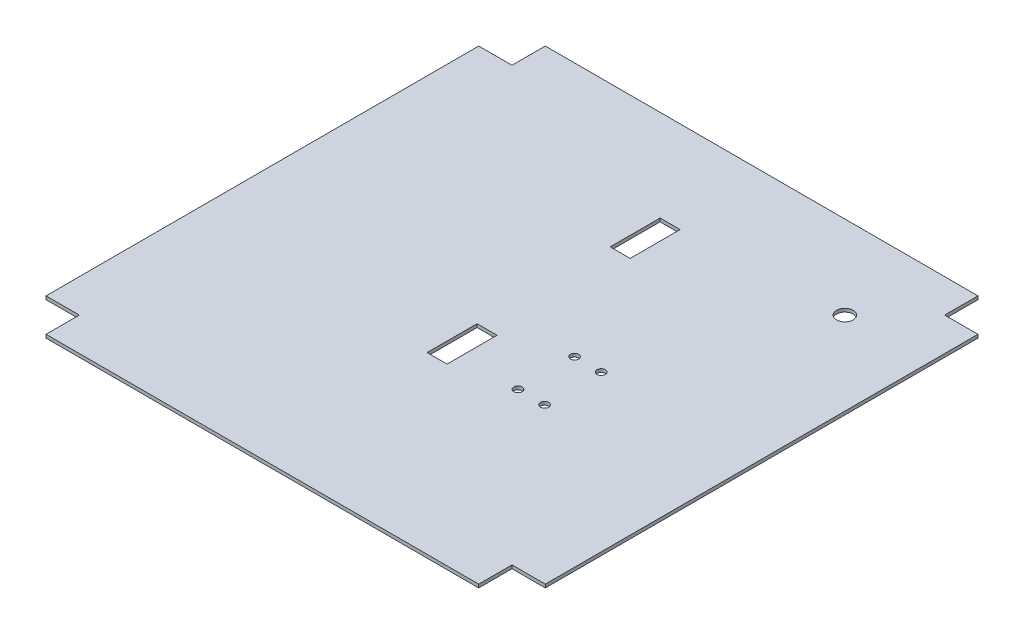
ISO-10303-21;
HEADER;
FILE_DESCRIPTION(('STEP AP214'),'2;1');
FILE_NAME('part.step','',(''),(''),'','','');
FILE_SCHEMA(('AUTOMOTIVE_DESIGN { 1 0 10303 214 1 1 1 1 }'));
ENDSEC;
DATA;
#1=APPLICATION_CONTEXT('core data for automotive mechanical design processes');
#2=APPLICATION_PROTOCOL_DEFINITION('international standard','automotive_design',2000,#1);
#3=PRODUCT_CONTEXT('',#1,'mechanical');
#4=PRODUCT('Part','Part','',(#3));
#5=PRODUCT_RELATED_PRODUCT_CATEGORY('part','',(#4));
#6=PRODUCT_DEFINITION_FORMATION('','',#4);
#7=PRODUCT_DEFINITION_CONTEXT('part definition',#1,'design');
#8=PRODUCT_DEFINITION('design','',#6,#7);
#9=PRODUCT_DEFINITION_SHAPE('','',#8);
#10=(LENGTH_UNIT() NAMED_UNIT(*) SI_UNIT(.MILLI.,.METRE.));
#11=(NAMED_UNIT(*) PLANE_ANGLE_UNIT() SI_UNIT($,.RADIAN.));
#12=(NAMED_UNIT(*) SI_UNIT($,.STERADIAN.) SOLID_ANGLE_UNIT());
#13=UNCERTAINTY_MEASURE_WITH_UNIT(LENGTH_MEASURE(1.E-05),#10,'distance_accuracy_value','');
#14=(GEOMETRIC_REPRESENTATION_CONTEXT(3) GLOBAL_UNCERTAINTY_ASSIGNED_CONTEXT((#13)) GLOBAL_UNIT_ASSIGNED_CONTEXT((#10,
#11,#12)) REPRESENTATION_CONTEXT('',''));
#15=CARTESIAN_POINT('',(0.,0.,0.));
#16=DIRECTION('',(0.,0.,1.));
#17=DIRECTION('',(1.,0.,0.));
#18=AXIS2_PLACEMENT_3D('',#15,#16,#17);
#19=CARTESIAN_POINT('',(-130.,2.,-150.));
#20=DIRECTION('',(0.,0.,1.));
#21=DIRECTION('',(1.,0.,0.));
#22=AXIS2_PLACEMENT_3D('',#19,#20,#21);
#23=PLANE('',#22);
#24=DIRECTION('',(-1.,0.,0.));
#25=VECTOR('',#24,1.);
#26=CARTESIAN_POINT('',(-130.,0.,-150.));
#27=LINE('',#26,#25);
#28=CARTESIAN_POINT('',(130.,0.,-150.));
#29=VERTEX_POINT('',#28);
#30=CARTESIAN_POINT('',(-130.,0.,-150.));
#31=VERTEX_POINT('',#30);
#32=EDGE_CURVE('E264',#29,#31,#27,.T.);
#33=ORIENTED_EDGE('',*,*,#32,.T.);
#34=DIRECTION('',(0.,-1.,0.));
#35=VECTOR('',#34,1.);
#36=CARTESIAN_POINT('',(-130.,2.,-150.));
#37=LINE('',#36,#35);
#38=CARTESIAN_POINT('',(-130.,2.,-150.));
#39=VERTEX_POINT('',#38);
#40=EDGE_CURVE('E320',#39,#31,#37,.T.);
#41=ORIENTED_EDGE('',*,*,#40,.F.);
#42=DIRECTION('',(-1.,0.,0.));
#43=VECTOR('',#42,1.);
#44=CARTESIAN_POINT('',(-130.,2.,-150.));
#45=LINE('',#44,#43);
#46=CARTESIAN_POINT('',(130.,2.,-150.));
#47=VERTEX_POINT('',#46);
#48=EDGE_CURVE('E237',#47,#39,#45,.T.);
#49=ORIENTED_EDGE('',*,*,#48,.F.);
#50=DIRECTION('',(0.,-1.,0.));
#51=VECTOR('',#50,1.);
#52=CARTESIAN_POINT('',(130.,2.,-150.));
#53=LINE('',#52,#51);
#54=EDGE_CURVE('E263',#47,#29,#53,.T.);
#55=ORIENTED_EDGE('',*,*,#54,.T.);
#56=EDGE_LOOP('',(#33,#41,#49,#55));
#57=FACE_BOUND('',#56,.T.);
#58=ADVANCED_FACE('F35',(#57),#23,.F.);
#59=CARTESIAN_POINT('',(-130.,2.,-150.));
#60=DIRECTION('',(1.,0.,0.));
#61=DIRECTION('',(0.,0.,-1.));
#62=AXIS2_PLACEMENT_3D('',#59,#60,#61);
#63=PLANE('',#62);
#64=DIRECTION('',(0.,0.,1.));
#65=VECTOR('',#64,1.);
#66=CARTESIAN_POINT('',(-130.,0.,-150.));
#67=LINE('',#66,#65);
#68=CARTESIAN_POINT('',(-130.,0.,-130.));
#69=VERTEX_POINT('',#68);
#70=EDGE_CURVE('E267',#31,#69,#67,.T.);
#71=ORIENTED_EDGE('',*,*,#70,.T.);
#72=DIRECTION('',(0.,-1.,0.));
#73=VECTOR('',#72,1.);
#74=CARTESIAN_POINT('',(-130.,2.,-130.));
#75=LINE('',#74,#73);
#76=CARTESIAN_POINT('',(-130.,2.,-130.));
#77=VERTEX_POINT('',#76);
#78=EDGE_CURVE('E317',#77,#69,#75,.T.);
#79=ORIENTED_EDGE('',*,*,#78,.F.);
#80=DIRECTION('',(0.,0.,1.));
#81=VECTOR('',#80,1.);
#82=CARTESIAN_POINT('',(-130.,2.,-150.));
#83=LINE('',#82,#81);
#84=EDGE_CURVE('E240',#39,#77,#83,.T.);
#85=ORIENTED_EDGE('',*,*,#84,.F.);
#86=ORIENTED_EDGE('',*,*,#40,.T.);
#87=EDGE_LOOP('',(#71,#79,#85,#86));
#88=FACE_BOUND('',#87,.T.);
#89=ADVANCED_FACE('F428',(#88),#63,.F.);
#90=CARTESIAN_POINT('',(-130.,2.,-130.));
#91=DIRECTION('',(0.,0.,1.));
#92=DIRECTION('',(1.,0.,0.));
#93=AXIS2_PLACEMENT_3D('',#90,#91,#92);
#94=PLANE('',#93);
#95=DIRECTION('',(-1.,0.,0.));
#96=VECTOR('',#95,1.);
#97=CARTESIAN_POINT('',(-130.,0.,-130.));
#98=LINE('',#97,#96);
#99=CARTESIAN_POINT('',(-150.,0.,-130.));
#100=VERTEX_POINT('',#99);
#101=EDGE_CURVE('E269',#69,#100,#98,.T.);
#102=ORIENTED_EDGE('',*,*,#101,.T.);
#103=DIRECTION('',(0.,-1.,0.));
#104=VECTOR('',#103,1.);
#105=CARTESIAN_POINT('',(-150.,2.,-130.));
#106=LINE('',#105,#104);
#107=CARTESIAN_POINT('',(-150.,2.,-130.));
#108=VERTEX_POINT('',#107);
#109=EDGE_CURVE('E314',#108,#100,#106,.T.);
#110=ORIENTED_EDGE('',*,*,#109,.F.);
#111=DIRECTION('',(-1.,0.,0.));
#112=VECTOR('',#111,1.);
#113=CARTESIAN_POINT('',(-130.,2.,-130.));
#114=LINE('',#113,#112);
#115=EDGE_CURVE('E243',#77,#108,#114,.T.);
#116=ORIENTED_EDGE('',*,*,#115,.F.);
#117=ORIENTED_EDGE('',*,*,#78,.T.);
#118=EDGE_LOOP('',(#102,#110,#116,#117));
#119=FACE_BOUND('',#118,.T.);
#120=ADVANCED_FACE('F425',(#119),#94,.F.);
#121=CARTESIAN_POINT('',(-150.,2.,-130.));
#122=DIRECTION('',(1.,0.,0.));
#123=DIRECTION('',(0.,0.,-1.));
#124=AXIS2_PLACEMENT_3D('',#121,#122,#123);
#125=PLANE('',#124);
#126=DIRECTION('',(0.,0.,1.));
#127=VECTOR('',#126,1.);
#128=CARTESIAN_POINT('',(-150.,0.,-130.));
#129=LINE('',#128,#127);
#130=CARTESIAN_POINT('',(-150.,0.,130.));
#131=VERTEX_POINT('',#130);
#132=EDGE_CURVE('E271',#100,#131,#129,.T.);
#133=ORIENTED_EDGE('',*,*,#132,.T.);
#134=DIRECTION('',(0.,-1.,0.));
#135=VECTOR('',#134,1.);
#136=CARTESIAN_POINT('',(-150.,2.,130.));
#137=LINE('',#136,#135);
#138=CARTESIAN_POINT('',(-150.,2.,130.));
#139=VERTEX_POINT('',#138);
#140=EDGE_CURVE('E311',#139,#131,#137,.T.);
#141=ORIENTED_EDGE('',*,*,#140,.F.);
#142=DIRECTION('',(0.,0.,1.));
#143=VECTOR('',#142,1.);
#144=CARTESIAN_POINT('',(-150.,2.,-130.));
#145=LINE('',#144,#143);
#146=EDGE_CURVE('E245',#108,#139,#145,.T.);
#147=ORIENTED_EDGE('',*,*,#146,.F.);
#148=ORIENTED_EDGE('',*,*,#109,.T.);
#149=EDGE_LOOP('',(#133,#141,#147,#148));
#150=FACE_BOUND('',#149,.T.);
#151=ADVANCED_FACE('F420',(#150),#125,.F.);
#152=CARTESIAN_POINT('',(-150.,2.,130.));
#153=DIRECTION('',(0.,0.,-1.));
#154=DIRECTION('',(-1.,0.,0.));
#155=AXIS2_PLACEMENT_3D('',#152,#153,#154);
#156=PLANE('',#155);
#157=DIRECTION('',(1.,0.,0.));
#158=VECTOR('',#157,1.);
#159=CARTESIAN_POINT('',(-150.,0.,130.));
#160=LINE('',#159,#158);
#161=CARTESIAN_POINT('',(-130.,0.,130.));
#162=VERTEX_POINT('',#161);
#163=EDGE_CURVE('E273',#131,#162,#160,.T.);
#164=ORIENTED_EDGE('',*,*,#163,.T.);
#165=DIRECTION('',(0.,-1.,0.));
#166=VECTOR('',#165,1.);
#167=CARTESIAN_POINT('',(-130.,2.,130.));
#168=LINE('',#167,#166);
#169=CARTESIAN_POINT('',(-130.,2.,130.));
#170=VERTEX_POINT('',#169);
#171=EDGE_CURVE('E308',#170,#162,#168,.T.);
#172=ORIENTED_EDGE('',*,*,#171,.F.);
#173=DIRECTION('',(1.,0.,0.));
#174=VECTOR('',#173,1.);
#175=CARTESIAN_POINT('',(-150.,2.,130.));
#176=LINE('',#175,#174);
#177=EDGE_CURVE('E247',#139,#170,#176,.T.);
#178=ORIENTED_EDGE('',*,*,#177,.F.);
#179=ORIENTED_EDGE('',*,*,#140,.T.);
#180=EDGE_LOOP('',(#164,#172,#178,#179));
#181=FACE_BOUND('',#180,.T.);
#182=ADVANCED_FACE('F416',(#181),#156,.F.);
#183=CARTESIAN_POINT('',(-130.,2.,130.));
#184=DIRECTION('',(1.,0.,0.));
#185=DIRECTION('',(0.,0.,-1.));
#186=AXIS2_PLACEMENT_3D('',#183,#184,#185);
#187=PLANE('',#186);
#188=DIRECTION('',(0.,0.,1.));
#189=VECTOR('',#188,1.);
#190=CARTESIAN_POINT('',(-130.,0.,130.));
#191=LINE('',#190,#189);
#192=CARTESIAN_POINT('',(-130.,0.,150.));
#193=VERTEX_POINT('',#192);
#194=EDGE_CURVE('E275',#162,#193,#191,.T.);
#195=ORIENTED_EDGE('',*,*,#194,.T.);
#196=DIRECTION('',(0.,-1.,0.));
#197=VECTOR('',#196,1.);
#198=CARTESIAN_POINT('',(-130.,2.,150.));
#199=LINE('',#198,#197);
#200=CARTESIAN_POINT('',(-130.,2.,150.));
#201=VERTEX_POINT('',#200);
#202=EDGE_CURVE('E305',#201,#193,#199,.T.);
#203=ORIENTED_EDGE('',*,*,#202,.F.);
#204=DIRECTION('',(0.,0.,1.));
#205=VECTOR('',#204,1.);
#206=CARTESIAN_POINT('',(-130.,2.,130.));
#207=LINE('',#206,#205);
#208=EDGE_CURVE('E249',#170,#201,#207,.T.);
#209=ORIENTED_EDGE('',*,*,#208,.F.);
#210=ORIENTED_EDGE('',*,*,#171,.T.);
#211=EDGE_LOOP('',(#195,#203,#209,#210));
#212=FACE_BOUND('',#211,.T.);
#213=ADVANCED_FACE('F412',(#212),#187,.F.);
#214=CARTESIAN_POINT('',(-130.,2.,150.));
#215=DIRECTION('',(0.,0.,-1.));
#216=DIRECTION('',(-1.,0.,0.));
#217=AXIS2_PLACEMENT_3D('',#214,#215,#216);
#218=PLANE('',#217);
#219=DIRECTION('',(1.,0.,0.));
#220=VECTOR('',#219,1.);
#221=CARTESIAN_POINT('',(-130.,0.,150.));
#222=LINE('',#221,#220);
#223=CARTESIAN_POINT('',(130.,0.,150.));
#224=VERTEX_POINT('',#223);
#225=EDGE_CURVE('E277',#193,#224,#222,.T.);
#226=ORIENTED_EDGE('',*,*,#225,.T.);
#227=DIRECTION('',(0.,-1.,0.));
#228=VECTOR('',#227,1.);
#229=CARTESIAN_POINT('',(130.,2.,150.));
#230=LINE('',#229,#228);
#231=CARTESIAN_POINT('',(130.,2.,150.));
#232=VERTEX_POINT('',#231);
#233=EDGE_CURVE('E302',#232,#224,#230,.T.);
#234=ORIENTED_EDGE('',*,*,#233,.F.);
#235=DIRECTION('',(1.,0.,0.));
#236=VECTOR('',#235,1.);
#237=CARTESIAN_POINT('',(-130.,2.,150.));
#238=LINE('',#237,#236);
#239=EDGE_CURVE('E251',#201,#232,#238,.T.);
#240=ORIENTED_EDGE('',*,*,#239,.F.);
#241=ORIENTED_EDGE('',*,*,#202,.T.);
#242=EDGE_LOOP('',(#226,#234,#240,#241));
#243=FACE_BOUND('',#242,.T.);
#244=ADVANCED_FACE('F407',(#243),#218,.F.);
#245=CARTESIAN_POINT('',(130.,2.,130.));
#246=DIRECTION('',(-1.,0.,0.));
#247=DIRECTION('',(0.,0.,1.));
#248=AXIS2_PLACEMENT_3D('',#245,#246,#247);
#249=PLANE('',#248);
#250=DIRECTION('',(0.,0.,-1.));
#251=VECTOR('',#250,1.);
#252=CARTESIAN_POINT('',(130.,0.,130.));
#253=LINE('',#252,#251);
#254=CARTESIAN_POINT('',(130.,0.,130.));
#255=VERTEX_POINT('',#254);
#256=EDGE_CURVE('E279',#224,#255,#253,.T.);
#257=ORIENTED_EDGE('',*,*,#256,.T.);
#258=DIRECTION('',(0.,-1.,0.));
#259=VECTOR('',#258,1.);
#260=CARTESIAN_POINT('',(130.,2.,130.));
#261=LINE('',#260,#259);
#262=CARTESIAN_POINT('',(130.,2.,130.));
#263=VERTEX_POINT('',#262);
#264=EDGE_CURVE('E299',#263,#255,#261,.T.);
#265=ORIENTED_EDGE('',*,*,#264,.F.);
#266=DIRECTION('',(0.,0.,-1.));
#267=VECTOR('',#266,1.);
#268=CARTESIAN_POINT('',(130.,2.,130.));
#269=LINE('',#268,#267);
#270=EDGE_CURVE('E253',#232,#263,#269,.T.);
#271=ORIENTED_EDGE('',*,*,#270,.F.);
#272=ORIENTED_EDGE('',*,*,#233,.T.);
#273=EDGE_LOOP('',(#257,#265,#271,#272));
#274=FACE_BOUND('',#273,.T.);
#275=ADVANCED_FACE('F401',(#274),#249,.F.);
#276=CARTESIAN_POINT('',(150.,2.,130.));
#277=DIRECTION('',(0.,0.,-1.));
#278=DIRECTION('',(-1.,0.,0.));
#279=AXIS2_PLACEMENT_3D('',#276,#277,#278);
#280=PLANE('',#279);
#281=DIRECTION('',(1.,0.,0.));
#282=VECTOR('',#281,1.);
#283=CARTESIAN_POINT('',(150.,0.,130.));
#284=LINE('',#283,#282);
#285=CARTESIAN_POINT('',(150.,0.,130.));
#286=VERTEX_POINT('',#285);
#287=EDGE_CURVE('E281',#255,#286,#284,.T.);
#288=ORIENTED_EDGE('',*,*,#287,.T.);
#289=DIRECTION('',(0.,-1.,0.));
#290=VECTOR('',#289,1.);
#291=CARTESIAN_POINT('',(150.,2.,130.));
#292=LINE('',#291,#290);
#293=CARTESIAN_POINT('',(150.,2.,130.));
#294=VERTEX_POINT('',#293);
#295=EDGE_CURVE('E296',#294,#286,#292,.T.);
#296=ORIENTED_EDGE('',*,*,#295,.F.);
#297=DIRECTION('',(1.,0.,0.));
#298=VECTOR('',#297,1.);
#299=CARTESIAN_POINT('',(150.,2.,130.));
#300=LINE('',#299,#298);
#301=EDGE_CURVE('E255',#263,#294,#300,.T.);
#302=ORIENTED_EDGE('',*,*,#301,.F.);
#303=ORIENTED_EDGE('',*,*,#264,.T.);
#304=EDGE_LOOP('',(#288,#296,#302,#303));
#305=FACE_BOUND('',#304,.T.);
#306=ADVANCED_FACE('F397',(#305),#280,.F.);
#307=CARTESIAN_POINT('',(150.,2.,-130.));
#308=DIRECTION('',(-1.,0.,0.));
#309=DIRECTION('',(0.,0.,1.));
#310=AXIS2_PLACEMENT_3D('',#307,#308,#309);
#311=PLANE('',#310);
#312=DIRECTION('',(0.,0.,-1.));
#313=VECTOR('',#312,1.);
#314=CARTESIAN_POINT('',(150.,0.,-130.));
#315=LINE('',#314,#313);
#316=CARTESIAN_POINT('',(150.,0.,-130.));
#317=VERTEX_POINT('',#316);
#318=EDGE_CURVE('E283',#286,#317,#315,.T.);
#319=ORIENTED_EDGE('',*,*,#318,.T.);
#320=DIRECTION('',(0.,-1.,0.));
#321=VECTOR('',#320,1.);
#322=CARTESIAN_POINT('',(150.,2.,-130.));
#323=LINE('',#322,#321);
#324=CARTESIAN_POINT('',(150.,2.,-130.));
#325=VERTEX_POINT('',#324);
#326=EDGE_CURVE('E293',#325,#317,#323,.T.);
#327=ORIENTED_EDGE('',*,*,#326,.F.);
#328=DIRECTION('',(0.,0.,-1.));
#329=VECTOR('',#328,1.);
#330=CARTESIAN_POINT('',(150.,2.,-130.));
#331=LINE('',#330,#329);
#332=EDGE_CURVE('E257',#294,#325,#331,.T.);
#333=ORIENTED_EDGE('',*,*,#332,.F.);
#334=ORIENTED_EDGE('',*,*,#295,.T.);
#335=EDGE_LOOP('',(#319,#327,#333,#334));
#336=FACE_BOUND('',#335,.T.);
#337=ADVANCED_FACE('F392',(#336),#311,.F.);
#338=CARTESIAN_POINT('',(130.,2.,-130.));
#339=DIRECTION('',(0.,0.,1.));
#340=DIRECTION('',(1.,0.,0.));
#341=AXIS2_PLACEMENT_3D('',#338,#339,#340);
#342=PLANE('',#341);
#343=DIRECTION('',(-1.,0.,0.));
#344=VECTOR('',#343,1.);
#345=CARTESIAN_POINT('',(130.,0.,-130.));
#346=LINE('',#345,#344);
#347=CARTESIAN_POINT('',(130.,0.,-130.));
#348=VERTEX_POINT('',#347);
#349=EDGE_CURVE('E285',#317,#348,#346,.T.);
#350=ORIENTED_EDGE('',*,*,#349,.T.);
#351=DIRECTION('',(0.,-1.,0.));
#352=VECTOR('',#351,1.);
#353=CARTESIAN_POINT('',(130.,2.,-130.));
#354=LINE('',#353,#352);
#355=CARTESIAN_POINT('',(130.,2.,-130.));
#356=VERTEX_POINT('',#355);
#357=EDGE_CURVE('E290',#356,#348,#354,.T.);
#358=ORIENTED_EDGE('',*,*,#357,.F.);
#359=DIRECTION('',(-1.,0.,0.));
#360=VECTOR('',#359,1.);
#361=CARTESIAN_POINT('',(130.,2.,-130.));
#362=LINE('',#361,#360);
#363=EDGE_CURVE('E259',#325,#356,#362,.T.);
#364=ORIENTED_EDGE('',*,*,#363,.F.);
#365=ORIENTED_EDGE('',*,*,#326,.T.);
#366=EDGE_LOOP('',(#350,#358,#364,#365));
#367=FACE_BOUND('',#366,.T.);
#368=ADVANCED_FACE('F386',(#367),#342,.F.);
#369=CARTESIAN_POINT('',(130.,2.,-150.));
#370=DIRECTION('',(-1.,0.,0.));
#371=DIRECTION('',(0.,0.,1.));
#372=AXIS2_PLACEMENT_3D('',#369,#370,#371);
#373=PLANE('',#372);
#374=DIRECTION('',(0.,0.,-1.));
#375=VECTOR('',#374,1.);
#376=CARTESIAN_POINT('',(130.,0.,-150.));
#377=LINE('',#376,#375);
#378=EDGE_CURVE('E241',#348,#29,#377,.T.);
#379=ORIENTED_EDGE('',*,*,#378,.T.);
#380=ORIENTED_EDGE('',*,*,#54,.F.);
#381=DIRECTION('',(0.,0.,-1.));
#382=VECTOR('',#381,1.);
#383=CARTESIAN_POINT('',(130.,2.,-150.));
#384=LINE('',#383,#382);
#385=EDGE_CURVE('E261',#356,#47,#384,.T.);
#386=ORIENTED_EDGE('',*,*,#385,.F.);
#387=ORIENTED_EDGE('',*,*,#357,.T.);
#388=EDGE_LOOP('',(#379,#380,#386,#387));
#389=FACE_BOUND('',#388,.T.);
#390=ADVANCED_FACE('F382',(#389),#373,.F.);
#391=CARTESIAN_POINT('',(0.,2.,0.));
#392=DIRECTION('',(0.,-1.,0.));
#393=DIRECTION('',(0.,0.,-1.));
#394=AXIS2_PLACEMENT_3D('',#391,#392,#393);
#395=PLANE('',#394);
#396=CARTESIAN_POINT('',(56.4500000000006,2.,36.85));
#397=DIRECTION('',(0.,1.,0.));
#398=DIRECTION('',(0.,0.,1.));
#399=AXIS2_PLACEMENT_3D('',#396,#397,#398);
#400=CIRCLE('',#399,2.49999999999962);
#401=CARTESIAN_POINT('',(56.4500000000006,2.,39.3499999999996));
#402=VERTEX_POINT('',#401);
#403=EDGE_CURVE('E215',#402,#402,#400,.T.);
#404=ORIENTED_EDGE('',*,*,#403,.F.);
#405=EDGE_LOOP('',(#404));
#406=FACE_BOUND('',#405,.T.);
#407=CARTESIAN_POINT('',(40.4500000000006,2.,36.8500000000001));
#408=DIRECTION('',(0.,1.,0.));
#409=DIRECTION('',(0.,0.,1.));
#410=AXIS2_PLACEMENT_3D('',#407,#408,#409);
#411=CIRCLE('',#410,2.5);
#412=CARTESIAN_POINT('',(40.4500000000006,2.,39.3500000000001));
#413=VERTEX_POINT('',#412);
#414=EDGE_CURVE('E212',#413,#413,#411,.T.);
#415=ORIENTED_EDGE('',*,*,#414,.F.);
#416=EDGE_LOOP('',(#415));
#417=FACE_BOUND('',#416,.T.);
#418=CARTESIAN_POINT('',(40.45,2.,2.8500000000001));
#419=DIRECTION('',(0.,1.,0.));
#420=DIRECTION('',(0.,0.,1.));
#421=AXIS2_PLACEMENT_3D('',#418,#419,#420);
#422=CIRCLE('',#421,2.49999999999989);
#423=CARTESIAN_POINT('',(40.45,2.,5.34999999999999));
#424=VERTEX_POINT('',#423);
#425=EDGE_CURVE('E209',#424,#424,#422,.T.);
#426=ORIENTED_EDGE('',*,*,#425,.F.);
#427=EDGE_LOOP('',(#426));
#428=FACE_BOUND('',#427,.T.);
#429=CARTESIAN_POINT('',(56.45,2.,2.84999999999999));
#430=DIRECTION('',(0.,1.,0.));
#431=DIRECTION('',(0.,0.,1.));
#432=AXIS2_PLACEMENT_3D('',#429,#430,#431);
#433=CIRCLE('',#432,2.5);
#434=CARTESIAN_POINT('',(56.45,2.,5.34999999999999));
#435=VERTEX_POINT('',#434);
#436=EDGE_CURVE('E206',#435,#435,#433,.T.);
#437=ORIENTED_EDGE('',*,*,#436,.F.);
#438=EDGE_LOOP('',(#437));
#439=FACE_BOUND('',#438,.T.);
#440=DIRECTION('',(0.,0.,1.));
#441=VECTOR('',#440,1.);
#442=CARTESIAN_POINT('',(-6.00000000000037,2.,-65.));
#443=LINE('',#442,#441);
#444=CARTESIAN_POINT('',(-6.00000000000037,2.,-95.));
#445=VERTEX_POINT('',#444);
#446=CARTESIAN_POINT('',(-6.00000000000037,2.,-65.));
#447=VERTEX_POINT('',#446);
#448=EDGE_CURVE('E189',#445,#447,#443,.T.);
#449=ORIENTED_EDGE('',*,*,#448,.F.);
#450=DIRECTION('',(-1.,0.,0.));
#451=VECTOR('',#450,1.);
#452=CARTESIAN_POINT('',(5.99999999999963,2.,-95.));
#453=LINE('',#452,#451);
#454=CARTESIAN_POINT('',(5.99999999999963,2.,-95.));
#455=VERTEX_POINT('',#454);
#456=EDGE_CURVE('E51',#455,#445,#453,.T.);
#457=ORIENTED_EDGE('',*,*,#456,.F.);
#458=DIRECTION('',(0.,0.,-1.));
#459=VECTOR('',#458,1.);
#460=CARTESIAN_POINT('',(5.99999999999963,2.,-65.));
#461=LINE('',#460,#459);
#462=CARTESIAN_POINT('',(5.99999999999963,2.,-65.));
#463=VERTEX_POINT('',#462);
#464=EDGE_CURVE('E196',#463,#455,#461,.T.);
#465=ORIENTED_EDGE('',*,*,#464,.F.);
#466=DIRECTION('',(1.,0.,0.));
#467=VECTOR('',#466,1.);
#468=CARTESIAN_POINT('',(5.99999999999963,2.,-65.));
#469=LINE('',#468,#467);
#470=EDGE_CURVE('E179',#447,#463,#469,.T.);
#471=ORIENTED_EDGE('',*,*,#470,.F.);
#472=EDGE_LOOP('',(#449,#457,#465,#471));
#473=FACE_BOUND('',#472,.T.);
#474=CARTESIAN_POINT('',(100.,2.,-100.));
#475=DIRECTION('',(0.,1.,0.));
#476=DIRECTION('',(0.,0.,1.));
#477=AXIS2_PLACEMENT_3D('',#474,#475,#476);
#478=CIRCLE('',#477,5.00000000000001);
#479=CARTESIAN_POINT('',(100.,2.,-95.));
#480=VERTEX_POINT('',#479);
#481=EDGE_CURVE('E203',#480,#480,#478,.T.);
#482=ORIENTED_EDGE('',*,*,#481,.F.);
#483=EDGE_LOOP('',(#482));
#484=FACE_BOUND('',#483,.T.);
#485=DIRECTION('',(1.,0.,0.));
#486=VECTOR('',#485,1.);
#487=CARTESIAN_POINT('',(6.,2.,45.));
#488=LINE('',#487,#486);
#489=CARTESIAN_POINT('',(-6.,2.,45.));
#490=VERTEX_POINT('',#489);
#491=CARTESIAN_POINT('',(6.,2.,45.));
#492=VERTEX_POINT('',#491);
#493=EDGE_CURVE('E219',#490,#492,#488,.T.);
#494=ORIENTED_EDGE('',*,*,#493,.F.);
#495=DIRECTION('',(0.,0.,1.));
#496=VECTOR('',#495,1.);
#497=CARTESIAN_POINT('',(-6.,2.,45.));
#498=LINE('',#497,#496);
#499=CARTESIAN_POINT('',(-6.,2.,15.));
#500=VERTEX_POINT('',#499);
#501=EDGE_CURVE('E59',#500,#490,#498,.T.);
#502=ORIENTED_EDGE('',*,*,#501,.F.);
#503=DIRECTION('',(-1.,0.,0.));
#504=VECTOR('',#503,1.);
#505=CARTESIAN_POINT('',(6.,2.,15.));
#506=LINE('',#505,#504);
#507=CARTESIAN_POINT('',(6.,2.,15.));
#508=VERTEX_POINT('',#507);
#509=EDGE_CURVE('E225',#508,#500,#506,.T.);
#510=ORIENTED_EDGE('',*,*,#509,.F.);
#511=DIRECTION('',(0.,0.,-1.));
#512=VECTOR('',#511,1.);
#513=CARTESIAN_POINT('',(6.,2.,45.));
#514=LINE('',#513,#512);
#515=EDGE_CURVE('E222',#492,#508,#514,.T.);
#516=ORIENTED_EDGE('',*,*,#515,.F.);
#517=EDGE_LOOP('',(#494,#502,#510,#516));
#518=FACE_BOUND('',#517,.T.);
#519=ORIENTED_EDGE('',*,*,#48,.T.);
#520=ORIENTED_EDGE('',*,*,#84,.T.);
#521=ORIENTED_EDGE('',*,*,#115,.T.);
#522=ORIENTED_EDGE('',*,*,#146,.T.);
#523=ORIENTED_EDGE('',*,*,#177,.T.);
#524=ORIENTED_EDGE('',*,*,#208,.T.);
#525=ORIENTED_EDGE('',*,*,#239,.T.);
#526=ORIENTED_EDGE('',*,*,#270,.T.);
#527=ORIENTED_EDGE('',*,*,#301,.T.);
#528=ORIENTED_EDGE('',*,*,#332,.T.);
#529=ORIENTED_EDGE('',*,*,#363,.T.);
#530=ORIENTED_EDGE('',*,*,#385,.T.);
#531=EDGE_LOOP('',(#519,#520,#521,#522,#523,#524,#525,#526,#527,#528,#529,#530));
#532=FACE_BOUND('',#531,.T.);
#533=ADVANCED_FACE('F193',(#406,#417,#428,#439,#473,#484,#518,#532),#395,.F.);
#534=CARTESIAN_POINT('',(0.,0.,0.));
#535=DIRECTION('',(0.,-1.,0.));
#536=DIRECTION('',(0.,0.,-1.));
#537=AXIS2_PLACEMENT_3D('',#534,#535,#536);
#538=PLANE('',#537);
#539=CARTESIAN_POINT('',(56.4500000000006,0.,36.85));
#540=DIRECTION('',(0.,-1.,0.));
#541=DIRECTION('',(0.,0.,-1.));
#542=AXIS2_PLACEMENT_3D('',#539,#540,#541);
#543=CIRCLE('',#542,2.49999999999962);
#544=CARTESIAN_POINT('',(56.4500000000006,0.,34.3500000000004));
#545=VERTEX_POINT('',#544);
#546=EDGE_CURVE('E38',#545,#545,#543,.T.);
#547=ORIENTED_EDGE('',*,*,#546,.F.);
#548=EDGE_LOOP('',(#547));
#549=FACE_BOUND('',#548,.T.);
#550=CARTESIAN_POINT('',(40.4500000000006,0.,36.8500000000001));
#551=DIRECTION('',(0.,-1.,0.));
#552=DIRECTION('',(0.,0.,-1.));
#553=AXIS2_PLACEMENT_3D('',#550,#551,#552);
#554=CIRCLE('',#553,2.5);
#555=CARTESIAN_POINT('',(40.4500000000006,0.,34.3500000000001));
#556=VERTEX_POINT('',#555);
#557=EDGE_CURVE('E343',#556,#556,#554,.T.);
#558=ORIENTED_EDGE('',*,*,#557,.F.);
#559=EDGE_LOOP('',(#558));
#560=FACE_BOUND('',#559,.T.);
#561=CARTESIAN_POINT('',(40.45,0.,2.8500000000001));
#562=DIRECTION('',(0.,-1.,0.));
#563=DIRECTION('',(0.,0.,-1.));
#564=AXIS2_PLACEMENT_3D('',#561,#562,#563);
#565=CIRCLE('',#564,2.49999999999989);
#566=CARTESIAN_POINT('',(40.45,0.,0.350000000000217));
#567=VERTEX_POINT('',#566);
#568=EDGE_CURVE('E341',#567,#567,#565,.T.);
#569=ORIENTED_EDGE('',*,*,#568,.F.);
#570=EDGE_LOOP('',(#569));
#571=FACE_BOUND('',#570,.T.);
#572=CARTESIAN_POINT('',(56.45,0.,2.84999999999999));
#573=DIRECTION('',(0.,-1.,0.));
#574=DIRECTION('',(0.,0.,-1.));
#575=AXIS2_PLACEMENT_3D('',#572,#573,#574);
#576=CIRCLE('',#575,2.5);
#577=CARTESIAN_POINT('',(56.45,0.,0.349999999999989));
#578=VERTEX_POINT('',#577);
#579=EDGE_CURVE('E335',#578,#578,#576,.T.);
#580=ORIENTED_EDGE('',*,*,#579,.F.);
#581=EDGE_LOOP('',(#580));
#582=FACE_BOUND('',#581,.T.);
#583=DIRECTION('',(1.,0.,0.));
#584=VECTOR('',#583,1.);
#585=CARTESIAN_POINT('',(0.,0.,-95.));
#586=LINE('',#585,#584);
#587=CARTESIAN_POINT('',(-6.00000000000037,0.,-95.));
#588=VERTEX_POINT('',#587);
#589=CARTESIAN_POINT('',(5.99999999999963,0.,-95.));
#590=VERTEX_POINT('',#589);
#591=EDGE_CURVE('E11',#588,#590,#586,.T.);
#592=ORIENTED_EDGE('',*,*,#591,.F.);
#593=DIRECTION('',(0.,0.,-1.));
#594=VECTOR('',#593,1.);
#595=CARTESIAN_POINT('',(-6.00000000000037,0.,0.));
#596=LINE('',#595,#594);
#597=CARTESIAN_POINT('',(-6.00000000000037,0.,-65.));
#598=VERTEX_POINT('',#597);
#599=EDGE_CURVE('E332',#598,#588,#596,.T.);
#600=ORIENTED_EDGE('',*,*,#599,.F.);
#601=DIRECTION('',(-1.,0.,0.));
#602=VECTOR('',#601,1.);
#603=CARTESIAN_POINT('',(1.50342701251323E-13,0.,-65.));
#604=LINE('',#603,#602);
#605=CARTESIAN_POINT('',(5.99999999999963,0.,-65.));
#606=VERTEX_POINT('',#605);
#607=EDGE_CURVE('E182',#606,#598,#604,.T.);
#608=ORIENTED_EDGE('',*,*,#607,.F.);
#609=DIRECTION('',(0.,0.,1.));
#610=VECTOR('',#609,1.);
#611=CARTESIAN_POINT('',(5.99999999999963,0.,0.));
#612=LINE('',#611,#610);
#613=EDGE_CURVE('E43',#590,#606,#612,.T.);
#614=ORIENTED_EDGE('',*,*,#613,.F.);
#615=EDGE_LOOP('',(#592,#600,#608,#614));
#616=FACE_BOUND('',#615,.T.);
#617=CARTESIAN_POINT('',(100.,0.,-100.));
#618=DIRECTION('',(0.,-1.,0.));
#619=DIRECTION('',(0.,0.,-1.));
#620=AXIS2_PLACEMENT_3D('',#617,#618,#619);
#621=CIRCLE('',#620,5.00000000000001);
#622=CARTESIAN_POINT('',(100.,0.,-105.));
#623=VERTEX_POINT('',#622);
#624=EDGE_CURVE('E231',#623,#623,#621,.T.);
#625=ORIENTED_EDGE('',*,*,#624,.F.);
#626=EDGE_LOOP('',(#625));
#627=FACE_BOUND('',#626,.T.);
#628=DIRECTION('',(0.,0.,-1.));
#629=VECTOR('',#628,1.);
#630=CARTESIAN_POINT('',(-6.,0.,0.));
#631=LINE('',#630,#629);
#632=CARTESIAN_POINT('',(-6.,0.,45.));
#633=VERTEX_POINT('',#632);
#634=CARTESIAN_POINT('',(-6.,0.,15.));
#635=VERTEX_POINT('',#634);
#636=EDGE_CURVE('E330',#633,#635,#631,.T.);
#637=ORIENTED_EDGE('',*,*,#636,.F.);
#638=DIRECTION('',(-1.,0.,0.));
#639=VECTOR('',#638,1.);
#640=CARTESIAN_POINT('',(0.,0.,45.));
#641=LINE('',#640,#639);
#642=CARTESIAN_POINT('',(6.,0.,45.));
#643=VERTEX_POINT('',#642);
#644=EDGE_CURVE('E323',#643,#633,#641,.T.);
#645=ORIENTED_EDGE('',*,*,#644,.F.);
#646=DIRECTION('',(0.,0.,1.));
#647=VECTOR('',#646,1.);
#648=CARTESIAN_POINT('',(6.,0.,0.));
#649=LINE('',#648,#647);
#650=CARTESIAN_POINT('',(6.,0.,15.));
#651=VERTEX_POINT('',#650);
#652=EDGE_CURVE('E325',#651,#643,#649,.T.);
#653=ORIENTED_EDGE('',*,*,#652,.F.);
#654=DIRECTION('',(1.,0.,0.));
#655=VECTOR('',#654,1.);
#656=CARTESIAN_POINT('',(0.,0.,15.));
#657=LINE('',#656,#655);
#658=EDGE_CURVE('E328',#635,#651,#657,.T.);
#659=ORIENTED_EDGE('',*,*,#658,.F.);
#660=EDGE_LOOP('',(#637,#645,#653,#659));
#661=FACE_BOUND('',#660,.T.);
#662=ORIENTED_EDGE('',*,*,#32,.F.);
#663=ORIENTED_EDGE('',*,*,#378,.F.);
#664=ORIENTED_EDGE('',*,*,#349,.F.);
#665=ORIENTED_EDGE('',*,*,#318,.F.);
#666=ORIENTED_EDGE('',*,*,#287,.F.);
#667=ORIENTED_EDGE('',*,*,#256,.F.);
#668=ORIENTED_EDGE('',*,*,#225,.F.);
#669=ORIENTED_EDGE('',*,*,#194,.F.);
#670=ORIENTED_EDGE('',*,*,#163,.F.);
#671=ORIENTED_EDGE('',*,*,#132,.F.);
#672=ORIENTED_EDGE('',*,*,#101,.F.);
#673=ORIENTED_EDGE('',*,*,#70,.F.);
#674=EDGE_LOOP('',(#662,#663,#664,#665,#666,#667,#668,#669,#670,#671,#672,#673));
#675=FACE_BOUND('',#674,.T.);
#676=ADVANCED_FACE('F353',(#549,#560,#571,#582,#616,#627,#661,#675),#538,.T.);
#677=CARTESIAN_POINT('',(-6.,-8.,45.));
#678=DIRECTION('',(-1.,0.,0.));
#679=DIRECTION('',(0.,0.,1.));
#680=AXIS2_PLACEMENT_3D('',#677,#678,#679);
#681=PLANE('',#680);
#682=ORIENTED_EDGE('',*,*,#636,.T.);
#683=DIRECTION('',(0.,1.,0.));
#684=VECTOR('',#683,1.);
#685=CARTESIAN_POINT('',(-6.,-8.,15.));
#686=LINE('',#685,#684);
#687=EDGE_CURVE('E229',#635,#500,#686,.T.);
#688=ORIENTED_EDGE('',*,*,#687,.T.);
#689=ORIENTED_EDGE('',*,*,#501,.T.);
#690=DIRECTION('',(0.,1.,0.));
#691=VECTOR('',#690,1.);
#692=CARTESIAN_POINT('',(-6.,-8.,45.));
#693=LINE('',#692,#691);
#694=EDGE_CURVE('E228',#633,#490,#693,.T.);
#695=ORIENTED_EDGE('',*,*,#694,.F.);
#696=EDGE_LOOP('',(#682,#688,#689,#695));
#697=FACE_BOUND('',#696,.T.);
#698=ADVANCED_FACE('F356',(#697),#681,.F.);
#699=CARTESIAN_POINT('',(6.,-8.,15.));
#700=DIRECTION('',(0.,0.,-1.));
#701=DIRECTION('',(-1.,0.,0.));
#702=AXIS2_PLACEMENT_3D('',#699,#700,#701);
#703=PLANE('',#702);
#704=ORIENTED_EDGE('',*,*,#658,.T.);
#705=DIRECTION('',(0.,1.,0.));
#706=VECTOR('',#705,1.);
#707=CARTESIAN_POINT('',(6.,-8.,15.));
#708=LINE('',#707,#706);
#709=EDGE_CURVE('E232',#651,#508,#708,.T.);
#710=ORIENTED_EDGE('',*,*,#709,.T.);
#711=ORIENTED_EDGE('',*,*,#509,.T.);
#712=ORIENTED_EDGE('',*,*,#687,.F.);
#713=EDGE_LOOP('',(#704,#710,#711,#712));
#714=FACE_BOUND('',#713,.T.);
#715=ADVANCED_FACE('F491',(#714),#703,.F.);
#716=CARTESIAN_POINT('',(6.,-8.,45.));
#717=DIRECTION('',(1.,0.,0.));
#718=DIRECTION('',(0.,0.,-1.));
#719=AXIS2_PLACEMENT_3D('',#716,#717,#718);
#720=PLANE('',#719);
#721=ORIENTED_EDGE('',*,*,#652,.T.);
#722=DIRECTION('',(0.,1.,0.));
#723=VECTOR('',#722,1.);
#724=CARTESIAN_POINT('',(6.,-8.,45.));
#725=LINE('',#724,#723);
#726=EDGE_CURVE('E234',#643,#492,#725,.T.);
#727=ORIENTED_EDGE('',*,*,#726,.T.);
#728=ORIENTED_EDGE('',*,*,#515,.T.);
#729=ORIENTED_EDGE('',*,*,#709,.F.);
#730=EDGE_LOOP('',(#721,#727,#728,#729));
#731=FACE_BOUND('',#730,.T.);
#732=ADVANCED_FACE('F499',(#731),#720,.F.);
#733=CARTESIAN_POINT('',(6.,-8.,45.));
#734=DIRECTION('',(0.,0.,1.));
#735=DIRECTION('',(1.,0.,0.));
#736=AXIS2_PLACEMENT_3D('',#733,#734,#735);
#737=PLANE('',#736);
#738=ORIENTED_EDGE('',*,*,#644,.T.);
#739=ORIENTED_EDGE('',*,*,#694,.T.);
#740=ORIENTED_EDGE('',*,*,#493,.T.);
#741=ORIENTED_EDGE('',*,*,#726,.F.);
#742=EDGE_LOOP('',(#738,#739,#740,#741));
#743=FACE_BOUND('',#742,.T.);
#744=ADVANCED_FACE('F509',(#743),#737,.F.);
#745=CARTESIAN_POINT('',(100.,-8.,-100.));
#746=DIRECTION('',(0.,1.,0.));
#747=DIRECTION('',(0.,0.,1.));
#748=AXIS2_PLACEMENT_3D('',#745,#746,#747);
#749=CYLINDRICAL_SURFACE('',#748,5.00000000000001);
#750=ORIENTED_EDGE('',*,*,#624,.T.);
#751=EDGE_LOOP('',(#750));
#752=FACE_BOUND('',#751,.T.);
#753=ORIENTED_EDGE('',*,*,#481,.T.);
#754=EDGE_LOOP('',(#753));
#755=FACE_BOUND('',#754,.T.);
#756=ADVANCED_FACE('F519',(#752,#755),#749,.F.);
#757=CARTESIAN_POINT('',(5.99999999999963,-8.,-95.));
#758=DIRECTION('',(0.,0.,-1.));
#759=DIRECTION('',(-1.,0.,0.));
#760=AXIS2_PLACEMENT_3D('',#757,#758,#759);
#761=PLANE('',#760);
#762=ORIENTED_EDGE('',*,*,#591,.T.);
#763=DIRECTION('',(0.,1.,0.));
#764=VECTOR('',#763,1.);
#765=CARTESIAN_POINT('',(5.99999999999963,-8.,-95.));
#766=LINE('',#765,#764);
#767=EDGE_CURVE('E201',#590,#455,#766,.T.);
#768=ORIENTED_EDGE('',*,*,#767,.T.);
#769=ORIENTED_EDGE('',*,*,#456,.T.);
#770=DIRECTION('',(0.,1.,0.));
#771=VECTOR('',#770,1.);
#772=CARTESIAN_POINT('',(-6.00000000000037,-8.,-95.));
#773=LINE('',#772,#771);
#774=EDGE_CURVE('E186',#588,#445,#773,.T.);
#775=ORIENTED_EDGE('',*,*,#774,.F.);
#776=EDGE_LOOP('',(#762,#768,#769,#775));
#777=FACE_BOUND('',#776,.T.);
#778=ADVANCED_FACE('F529',(#777),#761,.F.);
#779=CARTESIAN_POINT('',(5.99999999999963,-8.,-65.));
#780=DIRECTION('',(1.,0.,0.));
#781=DIRECTION('',(0.,0.,-1.));
#782=AXIS2_PLACEMENT_3D('',#779,#780,#781);
#783=PLANE('',#782);
#784=ORIENTED_EDGE('',*,*,#613,.T.);
#785=DIRECTION('',(0.,1.,0.));
#786=VECTOR('',#785,1.);
#787=CARTESIAN_POINT('',(5.99999999999963,-8.,-65.));
#788=LINE('',#787,#786);
#789=EDGE_CURVE('E185',#606,#463,#788,.T.);
#790=ORIENTED_EDGE('',*,*,#789,.T.);
#791=ORIENTED_EDGE('',*,*,#464,.T.);
#792=ORIENTED_EDGE('',*,*,#767,.F.);
#793=EDGE_LOOP('',(#784,#790,#791,#792));
#794=FACE_BOUND('',#793,.T.);
#795=ADVANCED_FACE('F539',(#794),#783,.F.);
#796=CARTESIAN_POINT('',(5.99999999999963,-8.,-65.));
#797=DIRECTION('',(0.,0.,1.));
#798=DIRECTION('',(1.,0.,0.));
#799=AXIS2_PLACEMENT_3D('',#796,#797,#798);
#800=PLANE('',#799);
#801=ORIENTED_EDGE('',*,*,#607,.T.);
#802=DIRECTION('',(0.,1.,0.));
#803=VECTOR('',#802,1.);
#804=CARTESIAN_POINT('',(-6.00000000000037,-8.,-65.));
#805=LINE('',#804,#803);
#806=EDGE_CURVE('E174',#598,#447,#805,.T.);
#807=ORIENTED_EDGE('',*,*,#806,.T.);
#808=ORIENTED_EDGE('',*,*,#470,.T.);
#809=ORIENTED_EDGE('',*,*,#789,.F.);
#810=EDGE_LOOP('',(#801,#807,#808,#809));
#811=FACE_BOUND('',#810,.T.);
#812=ADVANCED_FACE('F176',(#811),#800,.F.);
#813=CARTESIAN_POINT('',(-6.00000000000037,-8.,-65.));
#814=DIRECTION('',(-1.,0.,0.));
#815=DIRECTION('',(0.,0.,1.));
#816=AXIS2_PLACEMENT_3D('',#813,#814,#815);
#817=PLANE('',#816);
#818=ORIENTED_EDGE('',*,*,#599,.T.);
#819=ORIENTED_EDGE('',*,*,#774,.T.);
#820=ORIENTED_EDGE('',*,*,#448,.T.);
#821=ORIENTED_EDGE('',*,*,#806,.F.);
#822=EDGE_LOOP('',(#818,#819,#820,#821));
#823=FACE_BOUND('',#822,.T.);
#824=ADVANCED_FACE('F190',(#823),#817,.F.);
#825=CARTESIAN_POINT('',(56.45,-8.,2.84999999999999));
#826=DIRECTION('',(0.,1.,0.));
#827=DIRECTION('',(0.,0.,1.));
#828=AXIS2_PLACEMENT_3D('',#825,#826,#827);
#829=CYLINDRICAL_SURFACE('',#828,2.5);
#830=ORIENTED_EDGE('',*,*,#579,.T.);
#831=EDGE_LOOP('',(#830));
#832=FACE_BOUND('',#831,.T.);
#833=ORIENTED_EDGE('',*,*,#436,.T.);
#834=EDGE_LOOP('',(#833));
#835=FACE_BOUND('',#834,.T.);
#836=ADVANCED_FACE('F565',(#832,#835),#829,.F.);
#837=CARTESIAN_POINT('',(40.45,-8.,2.8500000000001));
#838=DIRECTION('',(0.,1.,0.));
#839=DIRECTION('',(0.,0.,1.));
#840=AXIS2_PLACEMENT_3D('',#837,#838,#839);
#841=CYLINDRICAL_SURFACE('',#840,2.49999999999989);
#842=ORIENTED_EDGE('',*,*,#568,.T.);
#843=EDGE_LOOP('',(#842));
#844=FACE_BOUND('',#843,.T.);
#845=ORIENTED_EDGE('',*,*,#425,.T.);
#846=EDGE_LOOP('',(#845));
#847=FACE_BOUND('',#846,.T.);
#848=ADVANCED_FACE('F574',(#844,#847),#841,.F.);
#849=CARTESIAN_POINT('',(40.4500000000006,-8.,36.8500000000001));
#850=DIRECTION('',(0.,1.,0.));
#851=DIRECTION('',(0.,0.,1.));
#852=AXIS2_PLACEMENT_3D('',#849,#850,#851);
#853=CYLINDRICAL_SURFACE('',#852,2.5);
#854=ORIENTED_EDGE('',*,*,#557,.T.);
#855=EDGE_LOOP('',(#854));
#856=FACE_BOUND('',#855,.T.);
#857=ORIENTED_EDGE('',*,*,#414,.T.);
#858=EDGE_LOOP('',(#857));
#859=FACE_BOUND('',#858,.T.);
#860=ADVANCED_FACE('F584',(#856,#859),#853,.F.);
#861=CARTESIAN_POINT('',(56.4500000000006,-8.,36.85));
#862=DIRECTION('',(0.,1.,0.));
#863=DIRECTION('',(0.,0.,1.));
#864=AXIS2_PLACEMENT_3D('',#861,#862,#863);
#865=CYLINDRICAL_SURFACE('',#864,2.49999999999962);
#866=ORIENTED_EDGE('',*,*,#546,.T.);
#867=EDGE_LOOP('',(#866));
#868=FACE_BOUND('',#867,.T.);
#869=ORIENTED_EDGE('',*,*,#403,.T.);
#870=EDGE_LOOP('',(#869));
#871=FACE_BOUND('',#870,.T.);
#872=ADVANCED_FACE('F350',(#868,#871),#865,.F.);
#873=CLOSED_SHELL('',(#58,#89,#120,#151,#182,#213,#244,#275,#306,#337,#368,#390,#533,#676,#698,
#715,#732,#744,#756,#778,#795,#812,#824,#836,#848,#860,#872));
#874=MANIFOLD_SOLID_BREP('B2',#873);
#875=ADVANCED_BREP_SHAPE_REPRESENTATION('',(#18,#874),#14);
#876=SHAPE_DEFINITION_REPRESENTATION(#9,#875);
ENDSEC;
END-ISO-10303-21;
